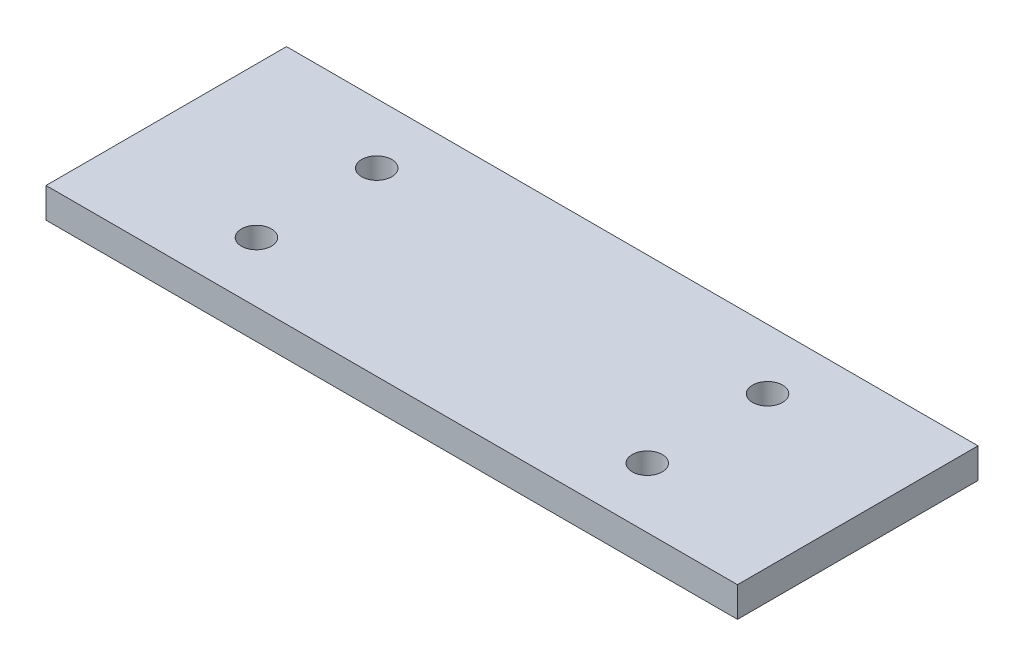
ISO-10303-21;
HEADER;
FILE_DESCRIPTION(('STEP AP214'),'2;1');
FILE_NAME('part.step','',(''),(''),'','','');
FILE_SCHEMA(('AUTOMOTIVE_DESIGN { 1 0 10303 214 1 1 1 1 }'));
ENDSEC;
DATA;
#1=APPLICATION_CONTEXT('core data for automotive mechanical design processes');
#2=APPLICATION_PROTOCOL_DEFINITION('international standard','automotive_design',2000,#1);
#3=PRODUCT_CONTEXT('',#1,'mechanical');
#4=PRODUCT('Part','Part','',(#3));
#5=PRODUCT_RELATED_PRODUCT_CATEGORY('part','',(#4));
#6=PRODUCT_DEFINITION_FORMATION('','',#4);
#7=PRODUCT_DEFINITION_CONTEXT('part definition',#1,'design');
#8=PRODUCT_DEFINITION('design','',#6,#7);
#9=PRODUCT_DEFINITION_SHAPE('','',#8);
#10=(LENGTH_UNIT() NAMED_UNIT(*) SI_UNIT(.MILLI.,.METRE.));
#11=(NAMED_UNIT(*) PLANE_ANGLE_UNIT() SI_UNIT($,.RADIAN.));
#12=(NAMED_UNIT(*) SI_UNIT($,.STERADIAN.) SOLID_ANGLE_UNIT());
#13=UNCERTAINTY_MEASURE_WITH_UNIT(LENGTH_MEASURE(1.E-05),#10,'distance_accuracy_value','');
#14=(GEOMETRIC_REPRESENTATION_CONTEXT(3) GLOBAL_UNCERTAINTY_ASSIGNED_CONTEXT((#13)) GLOBAL_UNIT_ASSIGNED_CONTEXT((#10,
#11,#12)) REPRESENTATION_CONTEXT('',''));
#15=CARTESIAN_POINT('',(0.,0.,0.));
#16=DIRECTION('',(0.,0.,1.));
#17=DIRECTION('',(1.,0.,0.));
#18=AXIS2_PLACEMENT_3D('',#15,#16,#17);
#19=CARTESIAN_POINT('',(0.,5.,0.));
#20=DIRECTION('',(0.,-1.,0.));
#21=DIRECTION('',(0.,0.,-1.));
#22=AXIS2_PLACEMENT_3D('',#19,#20,#21);
#23=PLANE('',#22);
#24=DIRECTION('',(0.,0.,-1.));
#25=VECTOR('',#24,1.);
#26=CARTESIAN_POINT('',(57.5,5.,20.));
#27=LINE('',#26,#25);
#28=CARTESIAN_POINT('',(57.5,5.,20.));
#29=VERTEX_POINT('',#28);
#30=CARTESIAN_POINT('',(57.5,5.,-20.));
#31=VERTEX_POINT('',#30);
#32=EDGE_CURVE('E89',#29,#31,#27,.T.);
#33=ORIENTED_EDGE('',*,*,#32,.T.);
#34=DIRECTION('',(-1.,0.,0.));
#35=VECTOR('',#34,1.);
#36=CARTESIAN_POINT('',(-57.5,5.,-20.));
#37=LINE('',#36,#35);
#38=CARTESIAN_POINT('',(-57.5,5.,-20.));
#39=VERTEX_POINT('',#38);
#40=EDGE_CURVE('E84',#31,#39,#37,.T.);
#41=ORIENTED_EDGE('',*,*,#40,.T.);
#42=DIRECTION('',(0.,0.,1.));
#43=VECTOR('',#42,1.);
#44=CARTESIAN_POINT('',(-57.5,5.,20.));
#45=LINE('',#44,#43);
#46=CARTESIAN_POINT('',(-57.5,5.,20.));
#47=VERTEX_POINT('',#46);
#48=EDGE_CURVE('E87',#39,#47,#45,.T.);
#49=ORIENTED_EDGE('',*,*,#48,.T.);
#50=DIRECTION('',(1.,0.,0.));
#51=VECTOR('',#50,1.);
#52=CARTESIAN_POINT('',(-57.5,5.,20.));
#53=LINE('',#52,#51);
#54=EDGE_CURVE('E54',#47,#29,#53,.T.);
#55=ORIENTED_EDGE('',*,*,#54,.T.);
#56=EDGE_LOOP('',(#33,#41,#49,#55));
#57=FACE_BOUND('',#56,.T.);
#58=CARTESIAN_POINT('',(-32.5,5.,-9.99999999999999));
#59=DIRECTION('',(0.,1.,0.));
#60=DIRECTION('',(0.,0.,1.));
#61=AXIS2_PLACEMENT_3D('',#58,#59,#60);
#62=CIRCLE('',#61,2.5);
#63=CARTESIAN_POINT('',(-32.5,5.,-7.49999999999999));
#64=VERTEX_POINT('',#63);
#65=EDGE_CURVE('E104',#64,#64,#62,.T.);
#66=ORIENTED_EDGE('',*,*,#65,.F.);
#67=EDGE_LOOP('',(#66));
#68=FACE_BOUND('',#67,.T.);
#69=CARTESIAN_POINT('',(-32.5,5.,10.));
#70=DIRECTION('',(0.,1.,0.));
#71=DIRECTION('',(0.,0.,1.));
#72=AXIS2_PLACEMENT_3D('',#69,#70,#71);
#73=CIRCLE('',#72,2.5);
#74=CARTESIAN_POINT('',(-32.5,5.,12.5));
#75=VERTEX_POINT('',#74);
#76=EDGE_CURVE('E119',#75,#75,#73,.T.);
#77=ORIENTED_EDGE('',*,*,#76,.F.);
#78=EDGE_LOOP('',(#77));
#79=FACE_BOUND('',#78,.T.);
#80=CARTESIAN_POINT('',(32.5,5.,-10.));
#81=DIRECTION('',(0.,1.,0.));
#82=DIRECTION('',(0.,0.,1.));
#83=AXIS2_PLACEMENT_3D('',#80,#81,#82);
#84=CIRCLE('',#83,2.5);
#85=CARTESIAN_POINT('',(32.5,5.,-7.49999999999999));
#86=VERTEX_POINT('',#85);
#87=EDGE_CURVE('E125',#86,#86,#84,.T.);
#88=ORIENTED_EDGE('',*,*,#87,.F.);
#89=EDGE_LOOP('',(#88));
#90=FACE_BOUND('',#89,.T.);
#91=CARTESIAN_POINT('',(32.5,5.,10.));
#92=DIRECTION('',(0.,1.,0.));
#93=DIRECTION('',(0.,0.,1.));
#94=AXIS2_PLACEMENT_3D('',#91,#92,#93);
#95=CIRCLE('',#94,2.5);
#96=CARTESIAN_POINT('',(32.5,5.,12.5));
#97=VERTEX_POINT('',#96);
#98=EDGE_CURVE('E131',#97,#97,#95,.T.);
#99=ORIENTED_EDGE('',*,*,#98,.F.);
#100=EDGE_LOOP('',(#99));
#101=FACE_BOUND('',#100,.T.);
#102=ADVANCED_FACE('F37',(#57,#68,#79,#90,#101),#23,.F.);
#103=CARTESIAN_POINT('',(0.,0.,0.));
#104=DIRECTION('',(0.,-1.,0.));
#105=DIRECTION('',(0.,0.,-1.));
#106=AXIS2_PLACEMENT_3D('',#103,#104,#105);
#107=PLANE('',#106);
#108=CARTESIAN_POINT('',(32.5,0.,-10.));
#109=DIRECTION('',(0.,1.,0.));
#110=DIRECTION('',(0.,0.,1.));
#111=AXIS2_PLACEMENT_3D('',#108,#109,#110);
#112=CIRCLE('',#111,2.5);
#113=CARTESIAN_POINT('',(32.5,0.,-7.49999999999999));
#114=VERTEX_POINT('',#113);
#115=EDGE_CURVE('E128',#114,#114,#112,.T.);
#116=ORIENTED_EDGE('',*,*,#115,.T.);
#117=EDGE_LOOP('',(#116));
#118=FACE_BOUND('',#117,.T.);
#119=CARTESIAN_POINT('',(-32.5,0.,-9.99999999999999));
#120=DIRECTION('',(0.,1.,0.));
#121=DIRECTION('',(0.,0.,1.));
#122=AXIS2_PLACEMENT_3D('',#119,#120,#121);
#123=CIRCLE('',#122,2.5);
#124=CARTESIAN_POINT('',(-32.5,0.,-7.49999999999999));
#125=VERTEX_POINT('',#124);
#126=EDGE_CURVE('E116',#125,#125,#123,.T.);
#127=ORIENTED_EDGE('',*,*,#126,.T.);
#128=EDGE_LOOP('',(#127));
#129=FACE_BOUND('',#128,.T.);
#130=DIRECTION('',(0.,0.,-1.));
#131=VECTOR('',#130,1.);
#132=CARTESIAN_POINT('',(57.5,0.,20.));
#133=LINE('',#132,#131);
#134=CARTESIAN_POINT('',(57.5,0.,20.));
#135=VERTEX_POINT('',#134);
#136=CARTESIAN_POINT('',(57.5,0.,-20.));
#137=VERTEX_POINT('',#136);
#138=EDGE_CURVE('E101',#135,#137,#133,.T.);
#139=ORIENTED_EDGE('',*,*,#138,.F.);
#140=DIRECTION('',(1.,0.,0.));
#141=VECTOR('',#140,1.);
#142=CARTESIAN_POINT('',(-57.5,0.,20.));
#143=LINE('',#142,#141);
#144=CARTESIAN_POINT('',(-57.5,0.,20.));
#145=VERTEX_POINT('',#144);
#146=EDGE_CURVE('E77',#145,#135,#143,.T.);
#147=ORIENTED_EDGE('',*,*,#146,.F.);
#148=DIRECTION('',(0.,0.,1.));
#149=VECTOR('',#148,1.);
#150=CARTESIAN_POINT('',(-57.5,0.,20.));
#151=LINE('',#150,#149);
#152=CARTESIAN_POINT('',(-57.5,0.,-20.));
#153=VERTEX_POINT('',#152);
#154=EDGE_CURVE('E71',#153,#145,#151,.T.);
#155=ORIENTED_EDGE('',*,*,#154,.F.);
#156=DIRECTION('',(-1.,0.,0.));
#157=VECTOR('',#156,1.);
#158=CARTESIAN_POINT('',(-57.5,0.,-20.));
#159=LINE('',#158,#157);
#160=EDGE_CURVE('E93',#137,#153,#159,.T.);
#161=ORIENTED_EDGE('',*,*,#160,.F.);
#162=EDGE_LOOP('',(#139,#147,#155,#161));
#163=FACE_BOUND('',#162,.T.);
#164=CARTESIAN_POINT('',(-32.5,0.,10.));
#165=DIRECTION('',(0.,1.,0.));
#166=DIRECTION('',(0.,0.,1.));
#167=AXIS2_PLACEMENT_3D('',#164,#165,#166);
#168=CIRCLE('',#167,2.5);
#169=CARTESIAN_POINT('',(-32.5,0.,12.5));
#170=VERTEX_POINT('',#169);
#171=EDGE_CURVE('E122',#170,#170,#168,.T.);
#172=ORIENTED_EDGE('',*,*,#171,.T.);
#173=EDGE_LOOP('',(#172));
#174=FACE_BOUND('',#173,.T.);
#175=CARTESIAN_POINT('',(32.5,0.,10.));
#176=DIRECTION('',(0.,1.,0.));
#177=DIRECTION('',(0.,0.,1.));
#178=AXIS2_PLACEMENT_3D('',#175,#176,#177);
#179=CIRCLE('',#178,2.5);
#180=CARTESIAN_POINT('',(32.5,0.,12.5));
#181=VERTEX_POINT('',#180);
#182=EDGE_CURVE('E134',#181,#181,#179,.T.);
#183=ORIENTED_EDGE('',*,*,#182,.T.);
#184=EDGE_LOOP('',(#183));
#185=FACE_BOUND('',#184,.T.);
#186=ADVANCED_FACE('F112',(#118,#129,#163,#174,#185),#107,.T.);
#187=CARTESIAN_POINT('',(57.5,5.,20.));
#188=DIRECTION('',(-1.,0.,0.));
#189=DIRECTION('',(0.,0.,1.));
#190=AXIS2_PLACEMENT_3D('',#187,#188,#189);
#191=PLANE('',#190);
#192=ORIENTED_EDGE('',*,*,#138,.T.);
#193=DIRECTION('',(0.,-1.,0.));
#194=VECTOR('',#193,1.);
#195=CARTESIAN_POINT('',(57.5,5.,-20.));
#196=LINE('',#195,#194);
#197=EDGE_CURVE('E11',#31,#137,#196,.T.);
#198=ORIENTED_EDGE('',*,*,#197,.F.);
#199=ORIENTED_EDGE('',*,*,#32,.F.);
#200=DIRECTION('',(0.,-1.,0.));
#201=VECTOR('',#200,1.);
#202=CARTESIAN_POINT('',(57.5,5.,20.));
#203=LINE('',#202,#201);
#204=EDGE_CURVE('E97',#29,#135,#203,.T.);
#205=ORIENTED_EDGE('',*,*,#204,.T.);
#206=EDGE_LOOP('',(#192,#198,#199,#205));
#207=FACE_BOUND('',#206,.T.);
#208=ADVANCED_FACE('F39',(#207),#191,.F.);
#209=CARTESIAN_POINT('',(-57.5,5.,-20.));
#210=DIRECTION('',(0.,0.,1.));
#211=DIRECTION('',(1.,0.,0.));
#212=AXIS2_PLACEMENT_3D('',#209,#210,#211);
#213=PLANE('',#212);
#214=ORIENTED_EDGE('',*,*,#160,.T.);
#215=DIRECTION('',(0.,-1.,0.));
#216=VECTOR('',#215,1.);
#217=CARTESIAN_POINT('',(-57.5,5.,-20.));
#218=LINE('',#217,#216);
#219=EDGE_CURVE('E46',#39,#153,#218,.T.);
#220=ORIENTED_EDGE('',*,*,#219,.F.);
#221=ORIENTED_EDGE('',*,*,#40,.F.);
#222=ORIENTED_EDGE('',*,*,#197,.T.);
#223=EDGE_LOOP('',(#214,#220,#221,#222));
#224=FACE_BOUND('',#223,.T.);
#225=ADVANCED_FACE('F92',(#224),#213,.F.);
#226=CARTESIAN_POINT('',(-57.5,5.,20.));
#227=DIRECTION('',(1.,0.,0.));
#228=DIRECTION('',(0.,0.,-1.));
#229=AXIS2_PLACEMENT_3D('',#226,#227,#228);
#230=PLANE('',#229);
#231=ORIENTED_EDGE('',*,*,#154,.T.);
#232=DIRECTION('',(0.,-1.,0.));
#233=VECTOR('',#232,1.);
#234=CARTESIAN_POINT('',(-57.5,5.,20.));
#235=LINE('',#234,#233);
#236=EDGE_CURVE('E94',#47,#145,#235,.T.);
#237=ORIENTED_EDGE('',*,*,#236,.F.);
#238=ORIENTED_EDGE('',*,*,#48,.F.);
#239=ORIENTED_EDGE('',*,*,#219,.T.);
#240=EDGE_LOOP('',(#231,#237,#238,#239));
#241=FACE_BOUND('',#240,.T.);
#242=ADVANCED_FACE('F95',(#241),#230,.F.);
#243=CARTESIAN_POINT('',(-57.5,5.,20.));
#244=DIRECTION('',(0.,0.,-1.));
#245=DIRECTION('',(-1.,0.,0.));
#246=AXIS2_PLACEMENT_3D('',#243,#244,#245);
#247=PLANE('',#246);
#248=ORIENTED_EDGE('',*,*,#146,.T.);
#249=ORIENTED_EDGE('',*,*,#204,.F.);
#250=ORIENTED_EDGE('',*,*,#54,.F.);
#251=ORIENTED_EDGE('',*,*,#236,.T.);
#252=EDGE_LOOP('',(#248,#249,#250,#251));
#253=FACE_BOUND('',#252,.T.);
#254=ADVANCED_FACE('F109',(#253),#247,.F.);
#255=CARTESIAN_POINT('',(-32.5,5.,-9.99999999999999));
#256=DIRECTION('',(0.,-1.,0.));
#257=DIRECTION('',(0.,0.,-1.));
#258=AXIS2_PLACEMENT_3D('',#255,#256,#257);
#259=CYLINDRICAL_SURFACE('',#258,2.5);
#260=ORIENTED_EDGE('',*,*,#65,.T.);
#261=EDGE_LOOP('',(#260));
#262=FACE_BOUND('',#261,.T.);
#263=ORIENTED_EDGE('',*,*,#126,.F.);
#264=EDGE_LOOP('',(#263));
#265=FACE_BOUND('',#264,.T.);
#266=ADVANCED_FACE('F151',(#262,#265),#259,.F.);
#267=CARTESIAN_POINT('',(-32.5,5.,10.));
#268=DIRECTION('',(0.,-1.,0.));
#269=DIRECTION('',(0.,0.,-1.));
#270=AXIS2_PLACEMENT_3D('',#267,#268,#269);
#271=CYLINDRICAL_SURFACE('',#270,2.5);
#272=ORIENTED_EDGE('',*,*,#76,.T.);
#273=EDGE_LOOP('',(#272));
#274=FACE_BOUND('',#273,.T.);
#275=ORIENTED_EDGE('',*,*,#171,.F.);
#276=EDGE_LOOP('',(#275));
#277=FACE_BOUND('',#276,.T.);
#278=ADVANCED_FACE('F205',(#274,#277),#271,.F.);
#279=CARTESIAN_POINT('',(32.5,5.,-10.));
#280=DIRECTION('',(0.,-1.,0.));
#281=DIRECTION('',(0.,0.,-1.));
#282=AXIS2_PLACEMENT_3D('',#279,#280,#281);
#283=CYLINDRICAL_SURFACE('',#282,2.5);
#284=ORIENTED_EDGE('',*,*,#87,.T.);
#285=EDGE_LOOP('',(#284));
#286=FACE_BOUND('',#285,.T.);
#287=ORIENTED_EDGE('',*,*,#115,.F.);
#288=EDGE_LOOP('',(#287));
#289=FACE_BOUND('',#288,.T.);
#290=ADVANCED_FACE('F214',(#286,#289),#283,.F.);
#291=CARTESIAN_POINT('',(32.5,5.,10.));
#292=DIRECTION('',(0.,-1.,0.));
#293=DIRECTION('',(0.,0.,-1.));
#294=AXIS2_PLACEMENT_3D('',#291,#292,#293);
#295=CYLINDRICAL_SURFACE('',#294,2.5);
#296=ORIENTED_EDGE('',*,*,#98,.T.);
#297=EDGE_LOOP('',(#296));
#298=FACE_BOUND('',#297,.T.);
#299=ORIENTED_EDGE('',*,*,#182,.F.);
#300=EDGE_LOOP('',(#299));
#301=FACE_BOUND('',#300,.T.);
#302=ADVANCED_FACE('F140',(#298,#301),#295,.F.);
#303=CLOSED_SHELL('',(#102,#186,#208,#225,#242,#254,#266,#278,#290,#302));
#304=MANIFOLD_SOLID_BREP('B2',#303);
#305=ADVANCED_BREP_SHAPE_REPRESENTATION('',(#18,#304),#14);
#306=SHAPE_DEFINITION_REPRESENTATION(#9,#305);
ENDSEC;
END-ISO-10303-21;
